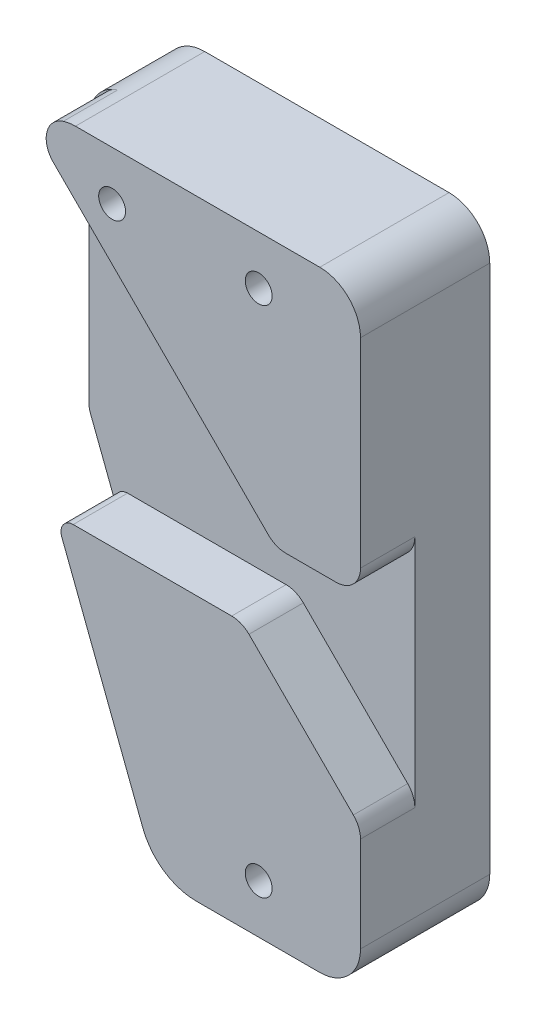
ISO-10303-21;
HEADER;
FILE_DESCRIPTION(('STEP AP214'),'2;1');
FILE_NAME('part.step','',(''),(''),'','','');
FILE_SCHEMA(('AUTOMOTIVE_DESIGN { 1 0 10303 214 1 1 1 1 }'));
ENDSEC;
DATA;
#1=APPLICATION_CONTEXT('core data for automotive mechanical design processes');
#2=APPLICATION_PROTOCOL_DEFINITION('international standard','automotive_design',2000,#1);
#3=PRODUCT_CONTEXT('',#1,'mechanical');
#4=PRODUCT('Part','Part','',(#3));
#5=PRODUCT_RELATED_PRODUCT_CATEGORY('part','',(#4));
#6=PRODUCT_DEFINITION_FORMATION('','',#4);
#7=PRODUCT_DEFINITION_CONTEXT('part definition',#1,'design');
#8=PRODUCT_DEFINITION('design','',#6,#7);
#9=PRODUCT_DEFINITION_SHAPE('','',#8);
#10=(LENGTH_UNIT() NAMED_UNIT(*) SI_UNIT(.MILLI.,.METRE.));
#11=(NAMED_UNIT(*) PLANE_ANGLE_UNIT() SI_UNIT($,.RADIAN.));
#12=(NAMED_UNIT(*) SI_UNIT($,.STERADIAN.) SOLID_ANGLE_UNIT());
#13=UNCERTAINTY_MEASURE_WITH_UNIT(LENGTH_MEASURE(1.E-05),#10,'distance_accuracy_value','');
#14=(GEOMETRIC_REPRESENTATION_CONTEXT(3) GLOBAL_UNCERTAINTY_ASSIGNED_CONTEXT((#13)) GLOBAL_UNIT_ASSIGNED_CONTEXT((#10,
#11,#12)) REPRESENTATION_CONTEXT('',''));
#15=CARTESIAN_POINT('',(0.,0.,0.));
#16=DIRECTION('',(0.,0.,1.));
#17=DIRECTION('',(1.,0.,0.));
#18=AXIS2_PLACEMENT_3D('',#15,#16,#17);
#19=CARTESIAN_POINT('',(-15.,0.,2.85));
#20=DIRECTION('',(1.,0.,0.));
#21=DIRECTION('',(0.,0.,-1.));
#22=AXIS2_PLACEMENT_3D('',#19,#20,#21);
#23=PLANE('',#22);
#24=DIRECTION('',(0.,-1.,0.));
#25=VECTOR('',#24,1.);
#26=CARTESIAN_POINT('',(-15.,0.,2.85));
#27=LINE('',#26,#25);
#28=CARTESIAN_POINT('',(-15.,70.,2.85000000000001));
#29=VERTEX_POINT('',#28);
#30=CARTESIAN_POINT('',(-15.,39.5,2.85));
#31=VERTEX_POINT('',#30);
#32=EDGE_CURVE('E308',#29,#31,#27,.T.);
#33=ORIENTED_EDGE('',*,*,#32,.F.);
#34=DIRECTION('',(0.,0.,-1.));
#35=VECTOR('',#34,1.);
#36=CARTESIAN_POINT('',(-15.,70.,2.85));
#37=LINE('',#36,#35);
#38=CARTESIAN_POINT('',(-15.,70.,-6.35));
#39=VERTEX_POINT('',#38);
#40=EDGE_CURVE('E314',#29,#39,#37,.T.);
#41=ORIENTED_EDGE('',*,*,#40,.T.);
#42=DIRECTION('',(0.,1.,0.));
#43=VECTOR('',#42,1.);
#44=CARTESIAN_POINT('',(-15.,0.,-6.35));
#45=LINE('',#44,#43);
#46=CARTESIAN_POINT('',(-15.,39.5,-6.35));
#47=VERTEX_POINT('',#46);
#48=EDGE_CURVE('E272',#47,#39,#45,.T.);
#49=ORIENTED_EDGE('',*,*,#48,.F.);
#50=DIRECTION('',(0.,0.,-1.));
#51=VECTOR('',#50,1.);
#52=CARTESIAN_POINT('',(-15.,39.5,2.85));
#53=LINE('',#52,#51);
#54=EDGE_CURVE('E333',#47,#31,#53,.F.);
#55=ORIENTED_EDGE('',*,*,#54,.T.);
#56=EDGE_LOOP('',(#33,#41,#49,#55));
#57=FACE_BOUND('',#56,.T.);
#58=ADVANCED_FACE('F41',(#57),#23,.F.);
#59=CARTESIAN_POINT('',(0.,42.5,6.35));
#60=DIRECTION('',(0.,1.,0.));
#61=DIRECTION('',(-1.,0.,0.));
#62=AXIS2_PLACEMENT_3D('',#59,#60,#61);
#63=PLANE('',#62);
#64=DIRECTION('',(1.,0.,0.));
#65=VECTOR('',#64,1.);
#66=CARTESIAN_POINT('',(0.,42.5,2.85));
#67=LINE('',#66,#65);
#68=CARTESIAN_POINT('',(15.8137084989848,42.5,2.85));
#69=VERTEX_POINT('',#68);
#70=CARTESIAN_POINT('',(22.,42.5,2.85));
#71=VERTEX_POINT('',#70);
#72=EDGE_CURVE('E304',#69,#71,#67,.T.);
#73=ORIENTED_EDGE('',*,*,#72,.T.);
#74=DIRECTION('',(0.,0.,1.));
#75=VECTOR('',#74,1.);
#76=CARTESIAN_POINT('',(22.,42.5,6.35));
#77=LINE('',#76,#75);
#78=CARTESIAN_POINT('',(22.,42.5,9.525));
#79=VERTEX_POINT('',#78);
#80=EDGE_CURVE('E355',#71,#79,#77,.T.);
#81=ORIENTED_EDGE('',*,*,#80,.T.);
#82=DIRECTION('',(1.,0.,0.));
#83=VECTOR('',#82,1.);
#84=CARTESIAN_POINT('',(0.,42.5,9.525));
#85=LINE('',#84,#83);
#86=CARTESIAN_POINT('',(15.8137084989848,42.5,9.525));
#87=VERTEX_POINT('',#86);
#88=EDGE_CURVE('E265',#87,#79,#85,.T.);
#89=ORIENTED_EDGE('',*,*,#88,.F.);
#90=DIRECTION('',(0.,0.,-1.));
#91=VECTOR('',#90,1.);
#92=CARTESIAN_POINT('',(15.8137084989848,42.5,6.35));
#93=LINE('',#92,#91);
#94=EDGE_CURVE('E207',#87,#69,#93,.T.);
#95=ORIENTED_EDGE('',*,*,#94,.T.);
#96=EDGE_LOOP('',(#73,#81,#89,#95));
#97=FACE_BOUND('',#96,.T.);
#98=ADVANCED_FACE('F459',(#97),#63,.F.);
#99=CARTESIAN_POINT('',(0.,75.,2.85));
#100=DIRECTION('',(0.,-1.,0.));
#101=DIRECTION('',(0.,0.,-1.));
#102=AXIS2_PLACEMENT_3D('',#99,#100,#101);
#103=PLANE('',#102);
#104=DIRECTION('',(0.,0.,-1.));
#105=VECTOR('',#104,1.);
#106=CARTESIAN_POINT('',(20.,75.,2.85));
#107=LINE('',#106,#105);
#108=CARTESIAN_POINT('',(20.,75.,9.525));
#109=VERTEX_POINT('',#108);
#110=CARTESIAN_POINT('',(20.,75.,-6.35));
#111=VERTEX_POINT('',#110);
#112=EDGE_CURVE('E317',#109,#111,#107,.T.);
#113=ORIENTED_EDGE('',*,*,#112,.T.);
#114=DIRECTION('',(1.,0.,0.));
#115=VECTOR('',#114,1.);
#116=CARTESIAN_POINT('',(0.,75.,-6.35));
#117=LINE('',#116,#115);
#118=CARTESIAN_POINT('',(-10.,75.,-6.35));
#119=VERTEX_POINT('',#118);
#120=EDGE_CURVE('E280',#119,#111,#117,.T.);
#121=ORIENTED_EDGE('',*,*,#120,.F.);
#122=DIRECTION('',(0.,0.,-1.));
#123=VECTOR('',#122,1.);
#124=CARTESIAN_POINT('',(-10.,75.,2.85));
#125=LINE('',#124,#123);
#126=CARTESIAN_POINT('',(-10.,75.,9.525));
#127=VERTEX_POINT('',#126);
#128=EDGE_CURVE('E320',#119,#127,#125,.F.);
#129=ORIENTED_EDGE('',*,*,#128,.T.);
#130=DIRECTION('',(-1.,0.,0.));
#131=VECTOR('',#130,1.);
#132=CARTESIAN_POINT('',(0.,75.,9.525));
#133=LINE('',#132,#131);
#134=EDGE_CURVE('E257',#109,#127,#133,.T.);
#135=ORIENTED_EDGE('',*,*,#134,.F.);
#136=EDGE_LOOP('',(#113,#121,#129,#135));
#137=FACE_BOUND('',#136,.T.);
#138=ADVANCED_FACE('F508',(#137),#103,.F.);
#139=CARTESIAN_POINT('',(0.,0.,2.85));
#140=DIRECTION('',(0.,1.,0.));
#141=DIRECTION('',(0.,0.,1.));
#142=AXIS2_PLACEMENT_3D('',#139,#140,#141);
#143=PLANE('',#142);
#144=DIRECTION('',(1.,0.,0.));
#145=VECTOR('',#144,1.);
#146=CARTESIAN_POINT('',(0.,0.,9.525));
#147=LINE('',#146,#145);
#148=CARTESIAN_POINT('',(4.81332293887137,0.,9.525));
#149=VERTEX_POINT('',#148);
#150=CARTESIAN_POINT('',(20.,0.,9.525));
#151=VERTEX_POINT('',#150);
#152=EDGE_CURVE('E239',#149,#151,#147,.T.);
#153=ORIENTED_EDGE('',*,*,#152,.F.);
#154=DIRECTION('',(0.,0.,-1.));
#155=VECTOR('',#154,1.);
#156=CARTESIAN_POINT('',(4.81332293887137,0.,-6.35));
#157=LINE('',#156,#155);
#158=CARTESIAN_POINT('',(4.81332293887137,0.,-6.35));
#159=VERTEX_POINT('',#158);
#160=EDGE_CURVE('E213',#149,#159,#157,.T.);
#161=ORIENTED_EDGE('',*,*,#160,.T.);
#162=DIRECTION('',(-1.,0.,0.));
#163=VECTOR('',#162,1.);
#164=CARTESIAN_POINT('',(0.,0.,-6.35));
#165=LINE('',#164,#163);
#166=CARTESIAN_POINT('',(20.,0.,-6.35));
#167=VERTEX_POINT('',#166);
#168=EDGE_CURVE('E296',#167,#159,#165,.T.);
#169=ORIENTED_EDGE('',*,*,#168,.F.);
#170=DIRECTION('',(0.,0.,-1.));
#171=VECTOR('',#170,1.);
#172=CARTESIAN_POINT('',(20.,0.,2.85));
#173=LINE('',#172,#171);
#174=EDGE_CURVE('E330',#167,#151,#173,.F.);
#175=ORIENTED_EDGE('',*,*,#174,.T.);
#176=EDGE_LOOP('',(#153,#161,#169,#175));
#177=FACE_BOUND('',#176,.T.);
#178=ADVANCED_FACE('F512',(#177),#143,.F.);
#179=CARTESIAN_POINT('',(25.,0.,2.85));
#180=DIRECTION('',(-1.,0.,0.));
#181=DIRECTION('',(0.,0.,1.));
#182=AXIS2_PLACEMENT_3D('',#179,#180,#181);
#183=PLANE('',#182);
#184=DIRECTION('',(0.,1.,0.));
#185=VECTOR('',#184,1.);
#186=CARTESIAN_POINT('',(25.,0.,9.525));
#187=LINE('',#186,#185);
#188=CARTESIAN_POINT('',(25.,45.5,9.525));
#189=VERTEX_POINT('',#188);
#190=CARTESIAN_POINT('',(25.,70.,9.525));
#191=VERTEX_POINT('',#190);
#192=EDGE_CURVE('E250',#189,#191,#187,.T.);
#193=ORIENTED_EDGE('',*,*,#192,.F.);
#194=DIRECTION('',(0.,0.,1.));
#195=VECTOR('',#194,1.);
#196=CARTESIAN_POINT('',(25.,45.5,2.85));
#197=LINE('',#196,#195);
#198=CARTESIAN_POINT('',(25.,45.5,2.85));
#199=VERTEX_POINT('',#198);
#200=EDGE_CURVE('E372',#189,#199,#197,.F.);
#201=ORIENTED_EDGE('',*,*,#200,.T.);
#202=DIRECTION('',(0.,1.,0.));
#203=VECTOR('',#202,1.);
#204=CARTESIAN_POINT('',(25.,0.,2.85));
#205=LINE('',#204,#203);
#206=CARTESIAN_POINT('',(25.,16.6862915010152,2.85));
#207=VERTEX_POINT('',#206);
#208=EDGE_CURVE('E311',#207,#199,#205,.T.);
#209=ORIENTED_EDGE('',*,*,#208,.F.);
#210=DIRECTION('',(0.,0.,1.));
#211=VECTOR('',#210,1.);
#212=CARTESIAN_POINT('',(25.,16.6862915010152,2.85));
#213=LINE('',#212,#211);
#214=CARTESIAN_POINT('',(25.,16.6862915010152,9.525));
#215=VERTEX_POINT('',#214);
#216=EDGE_CURVE('E368',#207,#215,#213,.T.);
#217=ORIENTED_EDGE('',*,*,#216,.T.);
#218=DIRECTION('',(0.,1.,0.));
#219=VECTOR('',#218,1.);
#220=CARTESIAN_POINT('',(25.,0.,9.525));
#221=LINE('',#220,#219);
#222=CARTESIAN_POINT('',(25.,5.,9.525));
#223=VERTEX_POINT('',#222);
#224=EDGE_CURVE('E246',#223,#215,#221,.T.);
#225=ORIENTED_EDGE('',*,*,#224,.F.);
#226=DIRECTION('',(0.,0.,-1.));
#227=VECTOR('',#226,1.);
#228=CARTESIAN_POINT('',(25.,5.,2.85));
#229=LINE('',#228,#227);
#230=CARTESIAN_POINT('',(25.,5.,-6.35));
#231=VERTEX_POINT('',#230);
#232=EDGE_CURVE('E327',#223,#231,#229,.T.);
#233=ORIENTED_EDGE('',*,*,#232,.T.);
#234=DIRECTION('',(0.,-1.,0.));
#235=VECTOR('',#234,1.);
#236=CARTESIAN_POINT('',(25.,0.,-6.35));
#237=LINE('',#236,#235);
#238=CARTESIAN_POINT('',(25.,70.,-6.35));
#239=VERTEX_POINT('',#238);
#240=EDGE_CURVE('E288',#239,#231,#237,.T.);
#241=ORIENTED_EDGE('',*,*,#240,.F.);
#242=DIRECTION('',(0.,0.,-1.));
#243=VECTOR('',#242,1.);
#244=CARTESIAN_POINT('',(25.,70.,2.85));
#245=LINE('',#244,#243);
#246=EDGE_CURVE('E323',#239,#191,#245,.F.);
#247=ORIENTED_EDGE('',*,*,#246,.T.);
#248=EDGE_LOOP('',(#193,#201,#209,#217,#225,#233,#241,#247));
#249=FACE_BOUND('',#248,.T.);
#250=ADVANCED_FACE('F453',(#249),#183,.F.);
#251=CARTESIAN_POINT('',(0.,0.,2.85));
#252=DIRECTION('',(0.,0.,1.));
#253=DIRECTION('',(1.,0.,0.));
#254=AXIS2_PLACEMENT_3D('',#251,#252,#253);
#255=PLANE('',#254);
#256=CARTESIAN_POINT('',(12.5,37.5,2.85));
#257=DIRECTION('',(0.,0.,1.));
#258=DIRECTION('',(1.,0.,0.));
#259=AXIS2_PLACEMENT_3D('',#256,#257,#258);
#260=CIRCLE('',#259,1.65);
#261=CARTESIAN_POINT('',(14.15,37.5,2.85));
#262=VERTEX_POINT('',#261);
#263=EDGE_CURVE('E197',#262,#262,#260,.T.);
#264=ORIENTED_EDGE('',*,*,#263,.F.);
#265=EDGE_LOOP('',(#264));
#266=FACE_BOUND('',#265,.T.);
#267=DIRECTION('',(-0.35794111613384,0.933744160560515,0.));
#268=VECTOR('',#267,1.);
#269=CARTESIAN_POINT('',(0.,0.,2.85));
#270=LINE('',#269,#268);
#271=CARTESIAN_POINT('',(-11.6777081954385,30.4630883257992,2.85));
#272=VERTEX_POINT('',#271);
#273=CARTESIAN_POINT('',(-14.867488321121,38.7841177677323,2.85));
#274=VERTEX_POINT('',#273);
#275=EDGE_CURVE('E56',#272,#274,#270,.T.);
#276=ORIENTED_EDGE('',*,*,#275,.F.);
#277=CARTESIAN_POINT('',(-10.2770919545977,31.,2.85));
#278=DIRECTION('',(0.,0.,1.));
#279=DIRECTION('',(1.,0.,0.));
#280=AXIS2_PLACEMENT_3D('',#277,#278,#279);
#281=CIRCLE('',#280,1.5);
#282=CARTESIAN_POINT('',(-10.2770919545977,32.5,2.85));
#283=VERTEX_POINT('',#282);
#284=EDGE_CURVE('E12',#272,#283,#281,.F.);
#285=ORIENTED_EDGE('',*,*,#284,.T.);
#286=DIRECTION('',(-1.,0.,0.));
#287=VECTOR('',#286,1.);
#288=CARTESIAN_POINT('',(0.,32.5,2.85));
#289=LINE('',#288,#287);
#290=CARTESIAN_POINT('',(9.18629150101523,32.5,2.85));
#291=VERTEX_POINT('',#290);
#292=EDGE_CURVE('E300',#291,#283,#289,.T.);
#293=ORIENTED_EDGE('',*,*,#292,.F.);
#294=CARTESIAN_POINT('',(9.18629150101523,29.5,2.85));
#295=DIRECTION('',(0.,0.,1.));
#296=DIRECTION('',(1.,0.,0.));
#297=AXIS2_PLACEMENT_3D('',#294,#295,#296);
#298=CIRCLE('',#297,3.);
#299=CARTESIAN_POINT('',(11.3076118445749,31.6213203435596,2.85000000000001));
#300=VERTEX_POINT('',#299);
#301=EDGE_CURVE('E409',#291,#300,#298,.F.);
#302=ORIENTED_EDGE('',*,*,#301,.T.);
#303=DIRECTION('',(-0.707106781186547,0.707106781186548,0.));
#304=VECTOR('',#303,1.);
#305=CARTESIAN_POINT('',(21.4644660940673,21.4644660940672,2.85000000000001));
#306=LINE('',#305,#304);
#307=CARTESIAN_POINT('',(24.1213203435596,18.8076118445749,2.85000000000001));
#308=VERTEX_POINT('',#307);
#309=EDGE_CURVE('E232',#308,#300,#306,.T.);
#310=ORIENTED_EDGE('',*,*,#309,.F.);
#311=CARTESIAN_POINT('',(22.,16.6862915010152,2.85));
#312=DIRECTION('',(0.,0.,1.));
#313=DIRECTION('',(1.,0.,0.));
#314=AXIS2_PLACEMENT_3D('',#311,#312,#313);
#315=CIRCLE('',#314,3.);
#316=EDGE_CURVE('E405',#308,#207,#315,.F.);
#317=ORIENTED_EDGE('',*,*,#316,.T.);
#318=ORIENTED_EDGE('',*,*,#208,.T.);
#319=CARTESIAN_POINT('',(22.,45.5,2.85));
#320=DIRECTION('',(0.,0.,1.));
#321=DIRECTION('',(1.,0.,0.));
#322=AXIS2_PLACEMENT_3D('',#319,#320,#321);
#323=CIRCLE('',#322,3.);
#324=EDGE_CURVE('E402',#199,#71,#323,.F.);
#325=ORIENTED_EDGE('',*,*,#324,.T.);
#326=ORIENTED_EDGE('',*,*,#72,.F.);
#327=CARTESIAN_POINT('',(15.8137084989848,45.5,2.85));
#328=DIRECTION('',(0.,0.,1.));
#329=DIRECTION('',(1.,0.,0.));
#330=AXIS2_PLACEMENT_3D('',#327,#328,#329);
#331=CIRCLE('',#330,3.);
#332=CARTESIAN_POINT('',(13.6923881554251,43.3786796564404,2.85000000000001));
#333=VERTEX_POINT('',#332);
#334=EDGE_CURVE('E412',#69,#333,#331,.F.);
#335=ORIENTED_EDGE('',*,*,#334,.T.);
#336=DIRECTION('',(0.707106781186548,-0.707106781186548,0.));
#337=VECTOR('',#336,1.);
#338=CARTESIAN_POINT('',(28.5355339059327,28.5355339059327,2.85000000000001));
#339=LINE('',#338,#337);
#340=CARTESIAN_POINT('',(-12.7168807597926,69.787948571658,2.85000000000001));
#341=VERTEX_POINT('',#340);
#342=EDGE_CURVE('E225',#341,#333,#339,.T.);
#343=ORIENTED_EDGE('',*,*,#342,.F.);
#344=CARTESIAN_POINT('',(-10.5955604162329,71.9092689152177,2.85));
#345=DIRECTION('',(0.,0.,1.));
#346=DIRECTION('',(1.,0.,0.));
#347=AXIS2_PLACEMENT_3D('',#344,#345,#346);
#348=CIRCLE('',#347,3.);
#349=CARTESIAN_POINT('',(-11.4889010405823,74.7731722880442,2.85000000000001));
#350=VERTEX_POINT('',#349);
#351=EDGE_CURVE('E415',#341,#350,#348,.F.);
#352=ORIENTED_EDGE('',*,*,#351,.T.);
#353=CARTESIAN_POINT('',(-10.,70.,2.85000000000001));
#354=DIRECTION('',(0.,0.,1.));
#355=DIRECTION('',(1.,0.,0.));
#356=AXIS2_PLACEMENT_3D('',#353,#354,#355);
#357=CIRCLE('',#356,5.);
#358=EDGE_CURVE('E229',#29,#350,#357,.F.);
#359=ORIENTED_EDGE('',*,*,#358,.F.);
#360=ORIENTED_EDGE('',*,*,#32,.T.);
#361=CARTESIAN_POINT('',(-13.,39.5,2.85));
#362=DIRECTION('',(0.,0.,1.));
#363=DIRECTION('',(1.,0.,0.));
#364=AXIS2_PLACEMENT_3D('',#361,#362,#363);
#365=CIRCLE('',#364,2.);
#366=EDGE_CURVE('E337',#31,#274,#365,.T.);
#367=ORIENTED_EDGE('',*,*,#366,.T.);
#368=EDGE_LOOP('',(#276,#285,#293,#302,#310,#317,#318,#325,#326,#335,#343,#352,#359,#360,#367));
#369=FACE_BOUND('',#368,.T.);
#370=ADVANCED_FACE('F430',(#266,#369),#255,.T.);
#371=CARTESIAN_POINT('',(-10.,70.,2.85));
#372=DIRECTION('',(0.,0.,-1.));
#373=DIRECTION('',(-1.,0.,0.));
#374=AXIS2_PLACEMENT_3D('',#371,#372,#373);
#375=CYLINDRICAL_SURFACE('',#374,5.);
#376=ORIENTED_EDGE('',*,*,#358,.T.);
#377=DIRECTION('',(0.,0.,-1.));
#378=VECTOR('',#377,1.);
#379=CARTESIAN_POINT('',(-11.4889010405823,74.7731722880442,2.85));
#380=LINE('',#379,#378);
#381=CARTESIAN_POINT('',(-11.4889010405823,74.7731722880442,9.525));
#382=VERTEX_POINT('',#381);
#383=EDGE_CURVE('E398',#350,#382,#380,.F.);
#384=ORIENTED_EDGE('',*,*,#383,.T.);
#385=CARTESIAN_POINT('',(-10.,70.,9.525));
#386=DIRECTION('',(0.,0.,1.));
#387=DIRECTION('',(1.,0.,0.));
#388=AXIS2_PLACEMENT_3D('',#385,#386,#387);
#389=CIRCLE('',#388,5.);
#390=EDGE_CURVE('E261',#127,#382,#389,.T.);
#391=ORIENTED_EDGE('',*,*,#390,.F.);
#392=ORIENTED_EDGE('',*,*,#128,.F.);
#393=CARTESIAN_POINT('',(-10.,70.,-6.35));
#394=DIRECTION('',(0.,0.,-1.));
#395=DIRECTION('',(-1.,0.,0.));
#396=AXIS2_PLACEMENT_3D('',#393,#394,#395);
#397=CIRCLE('',#396,5.);
#398=EDGE_CURVE('E276',#39,#119,#397,.T.);
#399=ORIENTED_EDGE('',*,*,#398,.F.);
#400=ORIENTED_EDGE('',*,*,#40,.F.);
#401=EDGE_LOOP('',(#376,#384,#391,#392,#399,#400));
#402=FACE_BOUND('',#401,.T.);
#403=ADVANCED_FACE('F480',(#402),#375,.T.);
#404=CARTESIAN_POINT('',(20.,5.,2.85));
#405=DIRECTION('',(0.,0.,-1.));
#406=DIRECTION('',(-1.,0.,0.));
#407=AXIS2_PLACEMENT_3D('',#404,#405,#406);
#408=CYLINDRICAL_SURFACE('',#407,5.);
#409=ORIENTED_EDGE('',*,*,#232,.F.);
#410=CARTESIAN_POINT('',(20.,5.,9.525));
#411=DIRECTION('',(0.,0.,1.));
#412=DIRECTION('',(1.,0.,0.));
#413=AXIS2_PLACEMENT_3D('',#410,#411,#412);
#414=CIRCLE('',#413,5.);
#415=EDGE_CURVE('E242',#151,#223,#414,.T.);
#416=ORIENTED_EDGE('',*,*,#415,.F.);
#417=ORIENTED_EDGE('',*,*,#174,.F.);
#418=CARTESIAN_POINT('',(20.,5.,-6.35));
#419=DIRECTION('',(0.,0.,-1.));
#420=DIRECTION('',(-1.,0.,0.));
#421=AXIS2_PLACEMENT_3D('',#418,#419,#420);
#422=CIRCLE('',#421,5.);
#423=EDGE_CURVE('E292',#231,#167,#422,.T.);
#424=ORIENTED_EDGE('',*,*,#423,.F.);
#425=EDGE_LOOP('',(#409,#416,#417,#424));
#426=FACE_BOUND('',#425,.T.);
#427=ADVANCED_FACE('F499',(#426),#408,.T.);
#428=CARTESIAN_POINT('',(20.,70.,2.85));
#429=DIRECTION('',(0.,0.,-1.));
#430=DIRECTION('',(-1.,0.,0.));
#431=AXIS2_PLACEMENT_3D('',#428,#429,#430);
#432=CYLINDRICAL_SURFACE('',#431,5.);
#433=ORIENTED_EDGE('',*,*,#112,.F.);
#434=CARTESIAN_POINT('',(20.,70.,9.525));
#435=DIRECTION('',(0.,0.,1.));
#436=DIRECTION('',(1.,0.,0.));
#437=AXIS2_PLACEMENT_3D('',#434,#435,#436);
#438=CIRCLE('',#437,5.);
#439=EDGE_CURVE('E253',#191,#109,#438,.T.);
#440=ORIENTED_EDGE('',*,*,#439,.F.);
#441=ORIENTED_EDGE('',*,*,#246,.F.);
#442=CARTESIAN_POINT('',(20.,70.,-6.35));
#443=DIRECTION('',(0.,0.,-1.));
#444=DIRECTION('',(-1.,0.,0.));
#445=AXIS2_PLACEMENT_3D('',#442,#443,#444);
#446=CIRCLE('',#445,5.);
#447=EDGE_CURVE('E284',#111,#239,#446,.T.);
#448=ORIENTED_EDGE('',*,*,#447,.F.);
#449=EDGE_LOOP('',(#433,#440,#441,#448));
#450=FACE_BOUND('',#449,.T.);
#451=ADVANCED_FACE('F492',(#450),#432,.T.);
#452=CARTESIAN_POINT('',(-13.,39.5,2.85));
#453=DIRECTION('',(0.,0.,1.));
#454=DIRECTION('',(1.,0.,0.));
#455=AXIS2_PLACEMENT_3D('',#452,#453,#454);
#456=CYLINDRICAL_SURFACE('',#455,2.);
#457=DIRECTION('',(0.,0.,-1.));
#458=VECTOR('',#457,1.);
#459=CARTESIAN_POINT('',(-14.867488321121,38.7841177677323,46.4266552549781));
#460=LINE('',#459,#458);
#461=CARTESIAN_POINT('',(-14.867488321121,38.7841177677323,-6.35));
#462=VERTEX_POINT('',#461);
#463=EDGE_CURVE('E222',#274,#462,#460,.T.);
#464=ORIENTED_EDGE('',*,*,#463,.F.);
#465=ORIENTED_EDGE('',*,*,#366,.F.);
#466=ORIENTED_EDGE('',*,*,#54,.F.);
#467=CARTESIAN_POINT('',(-13.,39.5,-6.35));
#468=DIRECTION('',(0.,0.,-1.));
#469=DIRECTION('',(-1.,0.,0.));
#470=AXIS2_PLACEMENT_3D('',#467,#468,#469);
#471=CIRCLE('',#470,2.);
#472=EDGE_CURVE('E269',#462,#47,#471,.T.);
#473=ORIENTED_EDGE('',*,*,#472,.F.);
#474=EDGE_LOOP('',(#464,#465,#466,#473));
#475=FACE_BOUND('',#474,.T.);
#476=ADVANCED_FACE('F490',(#475),#456,.T.);
#477=CARTESIAN_POINT('',(0.,32.5,6.35));
#478=DIRECTION('',(0.,-1.,0.));
#479=DIRECTION('',(0.,0.,-1.));
#480=AXIS2_PLACEMENT_3D('',#477,#478,#479);
#481=PLANE('',#480);
#482=ORIENTED_EDGE('',*,*,#292,.T.);
#483=DIRECTION('',(0.,0.,1.));
#484=VECTOR('',#483,1.);
#485=CARTESIAN_POINT('',(-10.2770919545977,32.5,9.525));
#486=LINE('',#485,#484);
#487=CARTESIAN_POINT('',(-10.2770919545977,32.5,9.525));
#488=VERTEX_POINT('',#487);
#489=EDGE_CURVE('E419',#283,#488,#486,.T.);
#490=ORIENTED_EDGE('',*,*,#489,.T.);
#491=DIRECTION('',(-1.,0.,0.));
#492=VECTOR('',#491,1.);
#493=CARTESIAN_POINT('',(0.,32.5,9.525));
#494=LINE('',#493,#492);
#495=CARTESIAN_POINT('',(9.18629150101523,32.5,9.525));
#496=VERTEX_POINT('',#495);
#497=EDGE_CURVE('E236',#496,#488,#494,.T.);
#498=ORIENTED_EDGE('',*,*,#497,.F.);
#499=DIRECTION('',(0.,0.,-1.));
#500=VECTOR('',#499,1.);
#501=CARTESIAN_POINT('',(9.18629150101523,32.5,6.35));
#502=LINE('',#501,#500);
#503=EDGE_CURVE('E388',#496,#291,#502,.T.);
#504=ORIENTED_EDGE('',*,*,#503,.T.);
#505=EDGE_LOOP('',(#482,#490,#498,#504));
#506=FACE_BOUND('',#505,.T.);
#507=ADVANCED_FACE('F432',(#506),#481,.F.);
#508=CARTESIAN_POINT('',(0.,0.,-6.35));
#509=DIRECTION('',(0.,0.,-1.));
#510=DIRECTION('',(-1.,0.,0.));
#511=AXIS2_PLACEMENT_3D('',#508,#509,#510);
#512=PLANE('',#511);
#513=CARTESIAN_POINT('',(-5.50000000000001,69.,-6.35));
#514=DIRECTION('',(0.,0.,-1.));
#515=DIRECTION('',(-1.,0.,0.));
#516=AXIS2_PLACEMENT_3D('',#513,#514,#515);
#517=CIRCLE('',#516,1.65);
#518=CARTESIAN_POINT('',(-7.15000000000001,69.,-6.35));
#519=VERTEX_POINT('',#518);
#520=EDGE_CURVE('E603',#519,#519,#517,.T.);
#521=ORIENTED_EDGE('',*,*,#520,.F.);
#522=EDGE_LOOP('',(#521));
#523=FACE_BOUND('',#522,.T.);
#524=CARTESIAN_POINT('',(12.5,6.,-6.35));
#525=DIRECTION('',(0.,0.,-1.));
#526=DIRECTION('',(-1.,0.,0.));
#527=AXIS2_PLACEMENT_3D('',#524,#525,#526);
#528=CIRCLE('',#527,1.65);
#529=CARTESIAN_POINT('',(10.85,6.,-6.35));
#530=VERTEX_POINT('',#529);
#531=EDGE_CURVE('E593',#530,#530,#528,.T.);
#532=ORIENTED_EDGE('',*,*,#531,.F.);
#533=EDGE_LOOP('',(#532));
#534=FACE_BOUND('',#533,.T.);
#535=CARTESIAN_POINT('',(12.5,37.5,-6.35));
#536=DIRECTION('',(0.,0.,-1.));
#537=DIRECTION('',(-1.,0.,0.));
#538=AXIS2_PLACEMENT_3D('',#535,#536,#537);
#539=CIRCLE('',#538,1.65);
#540=CARTESIAN_POINT('',(10.85,37.5,-6.35));
#541=VERTEX_POINT('',#540);
#542=EDGE_CURVE('E581',#541,#541,#539,.T.);
#543=ORIENTED_EDGE('',*,*,#542,.F.);
#544=EDGE_LOOP('',(#543));
#545=FACE_BOUND('',#544,.T.);
#546=CARTESIAN_POINT('',(12.5,69.,-6.35));
#547=DIRECTION('',(0.,0.,-1.));
#548=DIRECTION('',(-1.,0.,0.));
#549=AXIS2_PLACEMENT_3D('',#546,#547,#548);
#550=CIRCLE('',#549,1.65);
#551=CARTESIAN_POINT('',(10.85,69.,-6.35));
#552=VERTEX_POINT('',#551);
#553=EDGE_CURVE('E584',#552,#552,#550,.T.);
#554=ORIENTED_EDGE('',*,*,#553,.F.);
#555=EDGE_LOOP('',(#554));
#556=FACE_BOUND('',#555,.T.);
#557=ORIENTED_EDGE('',*,*,#168,.T.);
#558=CARTESIAN_POINT('',(4.81332293887137,7.,-6.35));
#559=DIRECTION('',(0.,0.,-1.));
#560=DIRECTION('',(-1.,0.,0.));
#561=AXIS2_PLACEMENT_3D('',#558,#559,#560);
#562=CIRCLE('',#561,7.);
#563=CARTESIAN_POINT('',(-1.72288618505223,4.49441218706312,-6.35));
#564=VERTEX_POINT('',#563);
#565=EDGE_CURVE('E208',#159,#564,#562,.T.);
#566=ORIENTED_EDGE('',*,*,#565,.T.);
#567=DIRECTION('',(-0.35794111613384,0.933744160560515,0.));
#568=VECTOR('',#567,1.);
#569=CARTESIAN_POINT('',(0.,0.,-6.35));
#570=LINE('',#569,#568);
#571=EDGE_CURVE('E204',#564,#462,#570,.T.);
#572=ORIENTED_EDGE('',*,*,#571,.T.);
#573=ORIENTED_EDGE('',*,*,#472,.T.);
#574=ORIENTED_EDGE('',*,*,#48,.T.);
#575=ORIENTED_EDGE('',*,*,#398,.T.);
#576=ORIENTED_EDGE('',*,*,#120,.T.);
#577=ORIENTED_EDGE('',*,*,#447,.T.);
#578=ORIENTED_EDGE('',*,*,#240,.T.);
#579=ORIENTED_EDGE('',*,*,#423,.T.);
#580=EDGE_LOOP('',(#557,#566,#572,#573,#574,#575,#576,#577,#578,#579));
#581=FACE_BOUND('',#580,.T.);
#582=ADVANCED_FACE('F484',(#523,#534,#545,#556,#581),#512,.T.);
#583=CARTESIAN_POINT('',(0.,0.,9.525));
#584=DIRECTION('',(0.,0.,1.));
#585=DIRECTION('',(1.,0.,0.));
#586=AXIS2_PLACEMENT_3D('',#583,#584,#585);
#587=PLANE('',#586);
#588=CARTESIAN_POINT('',(-5.50000000000001,69.,9.525));
#589=DIRECTION('',(0.,0.,-1.));
#590=DIRECTION('',(-1.,0.,0.));
#591=AXIS2_PLACEMENT_3D('',#588,#589,#590);
#592=CIRCLE('',#591,1.65);
#593=CARTESIAN_POINT('',(-7.15000000000001,69.,9.525));
#594=VERTEX_POINT('',#593);
#595=EDGE_CURVE('E599',#594,#594,#592,.T.);
#596=ORIENTED_EDGE('',*,*,#595,.T.);
#597=EDGE_LOOP('',(#596));
#598=FACE_BOUND('',#597,.T.);
#599=CARTESIAN_POINT('',(12.5,69.,9.525));
#600=DIRECTION('',(0.,0.,-1.));
#601=DIRECTION('',(-1.,0.,0.));
#602=AXIS2_PLACEMENT_3D('',#599,#600,#601);
#603=CIRCLE('',#602,1.65);
#604=CARTESIAN_POINT('',(10.85,69.,9.525));
#605=VERTEX_POINT('',#604);
#606=EDGE_CURVE('E590',#605,#605,#603,.T.);
#607=ORIENTED_EDGE('',*,*,#606,.T.);
#608=EDGE_LOOP('',(#607));
#609=FACE_BOUND('',#608,.T.);
#610=ORIENTED_EDGE('',*,*,#88,.T.);
#611=CARTESIAN_POINT('',(22.,45.5,9.525));
#612=DIRECTION('',(0.,0.,1.));
#613=DIRECTION('',(1.,0.,0.));
#614=AXIS2_PLACEMENT_3D('',#611,#612,#613);
#615=CIRCLE('',#614,3.);
#616=EDGE_CURVE('E365',#79,#189,#615,.T.);
#617=ORIENTED_EDGE('',*,*,#616,.T.);
#618=ORIENTED_EDGE('',*,*,#192,.T.);
#619=ORIENTED_EDGE('',*,*,#439,.T.);
#620=ORIENTED_EDGE('',*,*,#134,.T.);
#621=ORIENTED_EDGE('',*,*,#390,.T.);
#622=CARTESIAN_POINT('',(-10.5955604162329,71.9092689152177,9.525));
#623=DIRECTION('',(0.,0.,1.));
#624=DIRECTION('',(1.,0.,0.));
#625=AXIS2_PLACEMENT_3D('',#622,#623,#624);
#626=CIRCLE('',#625,3.);
#627=CARTESIAN_POINT('',(-12.7168807597926,69.787948571658,9.525));
#628=VERTEX_POINT('',#627);
#629=EDGE_CURVE('E359',#382,#628,#626,.T.);
#630=ORIENTED_EDGE('',*,*,#629,.T.);
#631=DIRECTION('',(-0.707106781186548,0.707106781186548,0.));
#632=VECTOR('',#631,1.);
#633=CARTESIAN_POINT('',(28.5355339059327,28.5355339059327,9.525));
#634=LINE('',#633,#632);
#635=CARTESIAN_POINT('',(13.6923881554251,43.3786796564404,9.525));
#636=VERTEX_POINT('',#635);
#637=EDGE_CURVE('E344',#636,#628,#634,.T.);
#638=ORIENTED_EDGE('',*,*,#637,.F.);
#639=CARTESIAN_POINT('',(15.8137084989848,45.5,9.525));
#640=DIRECTION('',(0.,0.,1.));
#641=DIRECTION('',(1.,0.,0.));
#642=AXIS2_PLACEMENT_3D('',#639,#640,#641);
#643=CIRCLE('',#642,3.);
#644=EDGE_CURVE('E362',#636,#87,#643,.T.);
#645=ORIENTED_EDGE('',*,*,#644,.T.);
#646=EDGE_LOOP('',(#610,#617,#618,#619,#620,#621,#630,#638,#645));
#647=FACE_BOUND('',#646,.T.);
#648=ADVANCED_FACE('F462',(#598,#609,#647),#587,.T.);
#649=CARTESIAN_POINT('',(0.,0.,9.525));
#650=DIRECTION('',(0.,0.,1.));
#651=DIRECTION('',(1.,0.,0.));
#652=AXIS2_PLACEMENT_3D('',#649,#650,#651);
#653=PLANE('',#652);
#654=CARTESIAN_POINT('',(12.5,6.,9.525));
#655=DIRECTION('',(0.,0.,-1.));
#656=DIRECTION('',(-1.,0.,0.));
#657=AXIS2_PLACEMENT_3D('',#654,#655,#656);
#658=CIRCLE('',#657,1.65);
#659=CARTESIAN_POINT('',(10.85,6.,9.525));
#660=VERTEX_POINT('',#659);
#661=EDGE_CURVE('E585',#660,#660,#658,.T.);
#662=ORIENTED_EDGE('',*,*,#661,.T.);
#663=EDGE_LOOP('',(#662));
#664=FACE_BOUND('',#663,.T.);
#665=ORIENTED_EDGE('',*,*,#497,.T.);
#666=CARTESIAN_POINT('',(-10.2770919545977,31.,9.525));
#667=DIRECTION('',(0.,0.,1.));
#668=DIRECTION('',(1.,0.,0.));
#669=AXIS2_PLACEMENT_3D('',#666,#667,#668);
#670=CIRCLE('',#669,1.5);
#671=CARTESIAN_POINT('',(-11.6777081954385,30.4630883257992,9.525));
#672=VERTEX_POINT('',#671);
#673=EDGE_CURVE('E64',#488,#672,#670,.T.);
#674=ORIENTED_EDGE('',*,*,#673,.T.);
#675=DIRECTION('',(0.35794111613384,-0.933744160560515,0.));
#676=VECTOR('',#675,1.);
#677=CARTESIAN_POINT('',(-1.72288618505223,4.49441218706312,9.525));
#678=LINE('',#677,#676);
#679=CARTESIAN_POINT('',(-1.72288618505224,4.49441218706312,9.525));
#680=VERTEX_POINT('',#679);
#681=EDGE_CURVE('E188',#672,#680,#678,.T.);
#682=ORIENTED_EDGE('',*,*,#681,.T.);
#683=CARTESIAN_POINT('',(4.81332293887137,7.,9.525));
#684=DIRECTION('',(0.,0.,1.));
#685=DIRECTION('',(1.,0.,0.));
#686=AXIS2_PLACEMENT_3D('',#683,#684,#685);
#687=CIRCLE('',#686,7.);
#688=EDGE_CURVE('E193',#680,#149,#687,.T.);
#689=ORIENTED_EDGE('',*,*,#688,.T.);
#690=ORIENTED_EDGE('',*,*,#152,.T.);
#691=ORIENTED_EDGE('',*,*,#415,.T.);
#692=ORIENTED_EDGE('',*,*,#224,.T.);
#693=CARTESIAN_POINT('',(22.,16.6862915010152,9.525));
#694=DIRECTION('',(0.,0.,1.));
#695=DIRECTION('',(1.,0.,0.));
#696=AXIS2_PLACEMENT_3D('',#693,#694,#695);
#697=CIRCLE('',#696,3.);
#698=CARTESIAN_POINT('',(24.1213203435596,18.8076118445749,9.525));
#699=VERTEX_POINT('',#698);
#700=EDGE_CURVE('E379',#215,#699,#697,.T.);
#701=ORIENTED_EDGE('',*,*,#700,.T.);
#702=DIRECTION('',(0.707106781186547,-0.707106781186548,0.));
#703=VECTOR('',#702,1.);
#704=CARTESIAN_POINT('',(21.4644660940673,21.4644660940672,9.525));
#705=LINE('',#704,#703);
#706=CARTESIAN_POINT('',(11.3076118445749,31.6213203435596,9.525));
#707=VERTEX_POINT('',#706);
#708=EDGE_CURVE('E340',#707,#699,#705,.T.);
#709=ORIENTED_EDGE('',*,*,#708,.F.);
#710=CARTESIAN_POINT('',(9.18629150101523,29.5,9.525));
#711=DIRECTION('',(0.,0.,1.));
#712=DIRECTION('',(1.,0.,0.));
#713=AXIS2_PLACEMENT_3D('',#710,#711,#712);
#714=CIRCLE('',#713,3.);
#715=EDGE_CURVE('E376',#707,#496,#714,.T.);
#716=ORIENTED_EDGE('',*,*,#715,.T.);
#717=EDGE_LOOP('',(#665,#674,#682,#689,#690,#691,#692,#701,#709,#716));
#718=FACE_BOUND('',#717,.T.);
#719=ADVANCED_FACE('F190',(#664,#718),#653,.T.);
#720=CARTESIAN_POINT('',(21.4644660940673,21.4644660940672,-64.4778780974998));
#721=DIRECTION('',(-0.707106781186548,-0.707106781186547,0.));
#722=DIRECTION('',(0.707106781186547,-0.707106781186548,0.));
#723=AXIS2_PLACEMENT_3D('',#720,#721,#722);
#724=PLANE('',#723);
#725=ORIENTED_EDGE('',*,*,#708,.T.);
#726=DIRECTION('',(0.,0.,1.));
#727=VECTOR('',#726,1.);
#728=CARTESIAN_POINT('',(24.1213203435596,18.8076118445749,-64.4778780974998));
#729=LINE('',#728,#727);
#730=EDGE_CURVE('E385',#699,#308,#729,.F.);
#731=ORIENTED_EDGE('',*,*,#730,.T.);
#732=ORIENTED_EDGE('',*,*,#309,.T.);
#733=DIRECTION('',(0.,0.,-1.));
#734=VECTOR('',#733,1.);
#735=CARTESIAN_POINT('',(11.3076118445749,31.6213203435596,-64.4778780974998));
#736=LINE('',#735,#734);
#737=EDGE_CURVE('E382',#300,#707,#736,.F.);
#738=ORIENTED_EDGE('',*,*,#737,.T.);
#739=EDGE_LOOP('',(#725,#731,#732,#738));
#740=FACE_BOUND('',#739,.T.);
#741=ADVANCED_FACE('F442',(#740),#724,.F.);
#742=CARTESIAN_POINT('',(28.5355339059327,28.5355339059327,-64.4778780974998));
#743=DIRECTION('',(0.707106781186548,0.707106781186548,0.));
#744=DIRECTION('',(-0.707106781186548,0.707106781186548,0.));
#745=AXIS2_PLACEMENT_3D('',#742,#743,#744);
#746=PLANE('',#745);
#747=ORIENTED_EDGE('',*,*,#342,.T.);
#748=DIRECTION('',(0.,0.,-1.));
#749=VECTOR('',#748,1.);
#750=CARTESIAN_POINT('',(13.6923881554251,43.3786796564404,-64.4778780974998));
#751=LINE('',#750,#749);
#752=EDGE_CURVE('E395',#333,#636,#751,.F.);
#753=ORIENTED_EDGE('',*,*,#752,.T.);
#754=ORIENTED_EDGE('',*,*,#637,.T.);
#755=DIRECTION('',(0.,0.,1.));
#756=VECTOR('',#755,1.);
#757=CARTESIAN_POINT('',(-12.7168807597925,69.787948571658,2.85000000000001));
#758=LINE('',#757,#756);
#759=EDGE_CURVE('E392',#628,#341,#758,.F.);
#760=ORIENTED_EDGE('',*,*,#759,.T.);
#761=EDGE_LOOP('',(#747,#753,#754,#760));
#762=FACE_BOUND('',#761,.T.);
#763=ADVANCED_FACE('F471',(#762),#746,.F.);
#764=CARTESIAN_POINT('',(0.,0.,46.4266552549781));
#765=DIRECTION('',(-0.933744160560515,-0.35794111613384,0.));
#766=DIRECTION('',(0.35794111613384,-0.933744160560515,0.));
#767=AXIS2_PLACEMENT_3D('',#764,#765,#766);
#768=PLANE('',#767);
#769=ORIENTED_EDGE('',*,*,#681,.F.);
#770=DIRECTION('',(0.,0.,1.));
#771=VECTOR('',#770,1.);
#772=CARTESIAN_POINT('',(-11.6777081954385,30.4630883257992,2.85));
#773=LINE('',#772,#771);
#774=EDGE_CURVE('E50',#672,#272,#773,.F.);
#775=ORIENTED_EDGE('',*,*,#774,.T.);
#776=ORIENTED_EDGE('',*,*,#275,.T.);
#777=ORIENTED_EDGE('',*,*,#463,.T.);
#778=ORIENTED_EDGE('',*,*,#571,.F.);
#779=DIRECTION('',(0.,0.,-1.));
#780=VECTOR('',#779,1.);
#781=CARTESIAN_POINT('',(-1.72288618505223,4.49441218706312,2.85));
#782=LINE('',#781,#780);
#783=EDGE_CURVE('E201',#564,#680,#782,.F.);
#784=ORIENTED_EDGE('',*,*,#783,.T.);
#785=EDGE_LOOP('',(#769,#775,#776,#777,#778,#784));
#786=FACE_BOUND('',#785,.T.);
#787=ADVANCED_FACE('F202',(#786),#768,.T.);
#788=CARTESIAN_POINT('',(4.81332293887137,7.,2.85));
#789=DIRECTION('',(0.,0.,1.));
#790=DIRECTION('',(1.,0.,0.));
#791=AXIS2_PLACEMENT_3D('',#788,#789,#790);
#792=CYLINDRICAL_SURFACE('',#791,7.);
#793=ORIENTED_EDGE('',*,*,#160,.F.);
#794=ORIENTED_EDGE('',*,*,#688,.F.);
#795=ORIENTED_EDGE('',*,*,#783,.F.);
#796=ORIENTED_EDGE('',*,*,#565,.F.);
#797=EDGE_LOOP('',(#793,#794,#795,#796));
#798=FACE_BOUND('',#797,.T.);
#799=ADVANCED_FACE('F211',(#798),#792,.T.);
#800=CARTESIAN_POINT('',(22.,45.5,6.35));
#801=DIRECTION('',(0.,0.,1.));
#802=DIRECTION('',(1.,0.,0.));
#803=AXIS2_PLACEMENT_3D('',#800,#801,#802);
#804=CYLINDRICAL_SURFACE('',#803,3.);
#805=ORIENTED_EDGE('',*,*,#324,.F.);
#806=ORIENTED_EDGE('',*,*,#200,.F.);
#807=ORIENTED_EDGE('',*,*,#616,.F.);
#808=ORIENTED_EDGE('',*,*,#80,.F.);
#809=EDGE_LOOP('',(#805,#806,#807,#808));
#810=FACE_BOUND('',#809,.T.);
#811=ADVANCED_FACE('F456',(#810),#804,.T.);
#812=CARTESIAN_POINT('',(22.,16.6862915010152,2.85));
#813=DIRECTION('',(0.,0.,1.));
#814=DIRECTION('',(1.,0.,0.));
#815=AXIS2_PLACEMENT_3D('',#812,#813,#814);
#816=CYLINDRICAL_SURFACE('',#815,3.);
#817=ORIENTED_EDGE('',*,*,#316,.F.);
#818=ORIENTED_EDGE('',*,*,#730,.F.);
#819=ORIENTED_EDGE('',*,*,#700,.F.);
#820=ORIENTED_EDGE('',*,*,#216,.F.);
#821=EDGE_LOOP('',(#817,#818,#819,#820));
#822=FACE_BOUND('',#821,.T.);
#823=ADVANCED_FACE('F446',(#822),#816,.T.);
#824=CARTESIAN_POINT('',(9.18629150101523,29.5,6.35));
#825=DIRECTION('',(0.,0.,-1.));
#826=DIRECTION('',(-1.,0.,0.));
#827=AXIS2_PLACEMENT_3D('',#824,#825,#826);
#828=CYLINDRICAL_SURFACE('',#827,3.);
#829=ORIENTED_EDGE('',*,*,#715,.F.);
#830=ORIENTED_EDGE('',*,*,#737,.F.);
#831=ORIENTED_EDGE('',*,*,#301,.F.);
#832=ORIENTED_EDGE('',*,*,#503,.F.);
#833=EDGE_LOOP('',(#829,#830,#831,#832));
#834=FACE_BOUND('',#833,.T.);
#835=ADVANCED_FACE('F437',(#834),#828,.T.);
#836=CARTESIAN_POINT('',(15.8137084989848,45.5,6.35));
#837=DIRECTION('',(0.,0.,-1.));
#838=DIRECTION('',(-1.,0.,0.));
#839=AXIS2_PLACEMENT_3D('',#836,#837,#838);
#840=CYLINDRICAL_SURFACE('',#839,3.);
#841=ORIENTED_EDGE('',*,*,#644,.F.);
#842=ORIENTED_EDGE('',*,*,#752,.F.);
#843=ORIENTED_EDGE('',*,*,#334,.F.);
#844=ORIENTED_EDGE('',*,*,#94,.F.);
#845=EDGE_LOOP('',(#841,#842,#843,#844));
#846=FACE_BOUND('',#845,.T.);
#847=ADVANCED_FACE('F467',(#846),#840,.T.);
#848=CARTESIAN_POINT('',(-10.5955604162329,71.9092689152177,2.85));
#849=DIRECTION('',(0.,0.,-1.));
#850=DIRECTION('',(-1.,0.,0.));
#851=AXIS2_PLACEMENT_3D('',#848,#849,#850);
#852=CYLINDRICAL_SURFACE('',#851,3.);
#853=ORIENTED_EDGE('',*,*,#351,.F.);
#854=ORIENTED_EDGE('',*,*,#759,.F.);
#855=ORIENTED_EDGE('',*,*,#629,.F.);
#856=ORIENTED_EDGE('',*,*,#383,.F.);
#857=EDGE_LOOP('',(#853,#854,#855,#856));
#858=FACE_BOUND('',#857,.T.);
#859=ADVANCED_FACE('F474',(#858),#852,.T.);
#860=CARTESIAN_POINT('',(-10.2770919545977,31.,6.35));
#861=DIRECTION('',(0.,0.,-1.));
#862=DIRECTION('',(-1.,0.,0.));
#863=AXIS2_PLACEMENT_3D('',#860,#861,#862);
#864=CYLINDRICAL_SURFACE('',#863,1.5);
#865=ORIENTED_EDGE('',*,*,#284,.F.);
#866=ORIENTED_EDGE('',*,*,#774,.F.);
#867=ORIENTED_EDGE('',*,*,#673,.F.);
#868=ORIENTED_EDGE('',*,*,#489,.F.);
#869=EDGE_LOOP('',(#865,#866,#867,#868));
#870=FACE_BOUND('',#869,.T.);
#871=ADVANCED_FACE('F43',(#870),#864,.T.);
#872=CARTESIAN_POINT('',(12.5,6.,9.525));
#873=DIRECTION('',(0.,0.,-1.));
#874=DIRECTION('',(-1.,0.,0.));
#875=AXIS2_PLACEMENT_3D('',#872,#873,#874);
#876=CYLINDRICAL_SURFACE('',#875,1.65);
#877=ORIENTED_EDGE('',*,*,#661,.F.);
#878=EDGE_LOOP('',(#877));
#879=FACE_BOUND('',#878,.T.);
#880=ORIENTED_EDGE('',*,*,#531,.T.);
#881=EDGE_LOOP('',(#880));
#882=FACE_BOUND('',#881,.T.);
#883=ADVANCED_FACE('F563',(#879,#882),#876,.F.);
#884=CARTESIAN_POINT('',(12.5,69.,9.525));
#885=DIRECTION('',(0.,0.,-1.));
#886=DIRECTION('',(-1.,0.,0.));
#887=AXIS2_PLACEMENT_3D('',#884,#885,#886);
#888=CYLINDRICAL_SURFACE('',#887,1.65);
#889=ORIENTED_EDGE('',*,*,#606,.F.);
#890=EDGE_LOOP('',(#889));
#891=FACE_BOUND('',#890,.T.);
#892=ORIENTED_EDGE('',*,*,#553,.T.);
#893=EDGE_LOOP('',(#892));
#894=FACE_BOUND('',#893,.T.);
#895=ADVANCED_FACE('F559',(#891,#894),#888,.F.);
#896=CARTESIAN_POINT('',(-5.50000000000001,69.,9.525));
#897=DIRECTION('',(0.,0.,-1.));
#898=DIRECTION('',(-1.,0.,0.));
#899=AXIS2_PLACEMENT_3D('',#896,#897,#898);
#900=CYLINDRICAL_SURFACE('',#899,1.65);
#901=ORIENTED_EDGE('',*,*,#595,.F.);
#902=EDGE_LOOP('',(#901));
#903=FACE_BOUND('',#902,.T.);
#904=ORIENTED_EDGE('',*,*,#520,.T.);
#905=EDGE_LOOP('',(#904));
#906=FACE_BOUND('',#905,.T.);
#907=ADVANCED_FACE('F562',(#903,#906),#900,.F.);
#908=CARTESIAN_POINT('',(12.5,37.5,9.525));
#909=DIRECTION('',(0.,0.,-1.));
#910=DIRECTION('',(-1.,0.,0.));
#911=AXIS2_PLACEMENT_3D('',#908,#909,#910);
#912=CYLINDRICAL_SURFACE('',#911,1.65);
#913=ORIENTED_EDGE('',*,*,#263,.T.);
#914=EDGE_LOOP('',(#913));
#915=FACE_BOUND('',#914,.T.);
#916=ORIENTED_EDGE('',*,*,#542,.T.);
#917=EDGE_LOOP('',(#916));
#918=FACE_BOUND('',#917,.T.);
#919=ADVANCED_FACE('F567',(#915,#918),#912,.F.);
#920=CLOSED_SHELL('',(#58,#98,#138,#178,#250,#370,#403,#427,#451,#476,#507,#582,#648,#719,#741,
#763,#787,#799,#811,#823,#835,#847,#859,#871,#883,#895,#907,#919));
#921=MANIFOLD_SOLID_BREP('B2',#920);
#922=ADVANCED_BREP_SHAPE_REPRESENTATION('',(#18,#921),#14);
#923=SHAPE_DEFINITION_REPRESENTATION(#9,#922);
ENDSEC;
END-ISO-10303-21;
